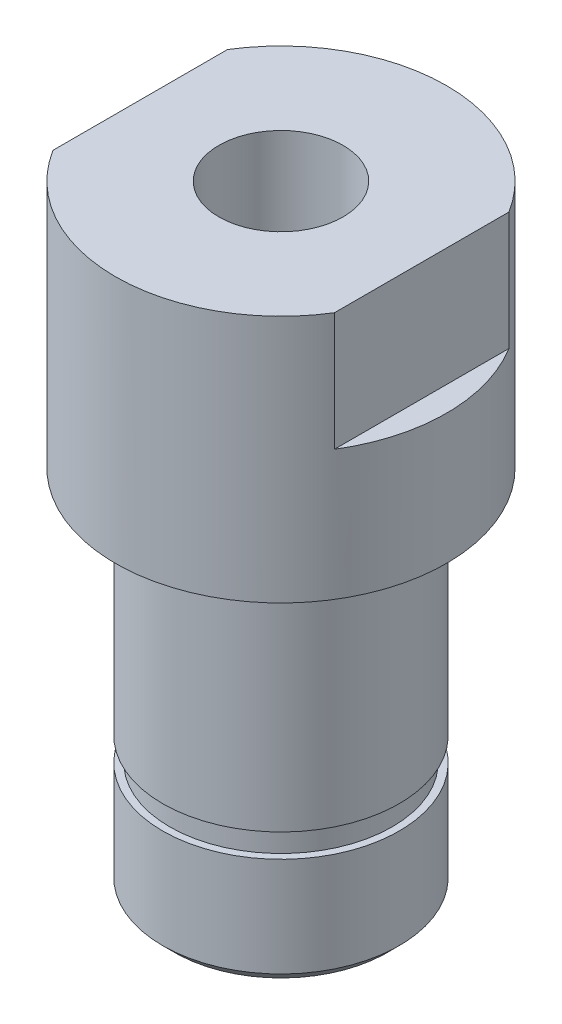
ISO-10303-21;
HEADER;
FILE_DESCRIPTION(('STEP AP214'),'2;1');
FILE_NAME('part.step','',(''),(''),'','','');
FILE_SCHEMA(('AUTOMOTIVE_DESIGN { 1 0 10303 214 1 1 1 1 }'));
ENDSEC;
DATA;
#1=APPLICATION_CONTEXT('core data for automotive mechanical design processes');
#2=APPLICATION_PROTOCOL_DEFINITION('international standard','automotive_design',2000,#1);
#3=PRODUCT_CONTEXT('',#1,'mechanical');
#4=PRODUCT('Part','Part','',(#3));
#5=PRODUCT_RELATED_PRODUCT_CATEGORY('part','',(#4));
#6=PRODUCT_DEFINITION_FORMATION('','',#4);
#7=PRODUCT_DEFINITION_CONTEXT('part definition',#1,'design');
#8=PRODUCT_DEFINITION('design','',#6,#7);
#9=PRODUCT_DEFINITION_SHAPE('','',#8);
#10=(LENGTH_UNIT() NAMED_UNIT(*) SI_UNIT(.MILLI.,.METRE.));
#11=(NAMED_UNIT(*) PLANE_ANGLE_UNIT() SI_UNIT($,.RADIAN.));
#12=(NAMED_UNIT(*) SI_UNIT($,.STERADIAN.) SOLID_ANGLE_UNIT());
#13=UNCERTAINTY_MEASURE_WITH_UNIT(LENGTH_MEASURE(1.E-05),#10,'distance_accuracy_value','');
#14=(GEOMETRIC_REPRESENTATION_CONTEXT(3) GLOBAL_UNCERTAINTY_ASSIGNED_CONTEXT((#13)) GLOBAL_UNIT_ASSIGNED_CONTEXT((#10,
#11,#12)) REPRESENTATION_CONTEXT('',''));
#15=CARTESIAN_POINT('',(0.,0.,0.));
#16=DIRECTION('',(0.,0.,1.));
#17=DIRECTION('',(1.,0.,0.));
#18=AXIS2_PLACEMENT_3D('',#15,#16,#17);
#19=CARTESIAN_POINT('',(0.,-46.,0.));
#20=DIRECTION('',(0.,1.,0.));
#21=DIRECTION('',(0.,0.,1.));
#22=AXIS2_PLACEMENT_3D('',#19,#20,#21);
#23=CYLINDRICAL_SURFACE('',#22,10.);
#24=CARTESIAN_POINT('',(0.,-15.,0.));
#25=DIRECTION('',(0.,-1.,0.));
#26=DIRECTION('',(0.,0.,-1.));
#27=AXIS2_PLACEMENT_3D('',#24,#25,#26);
#28=CIRCLE('',#27,10.);
#29=CARTESIAN_POINT('',(0.,-15.,-10.));
#30=VERTEX_POINT('',#29);
#31=EDGE_CURVE('E131',#30,#30,#28,.T.);
#32=ORIENTED_EDGE('',*,*,#31,.T.);
#33=EDGE_LOOP('',(#32));
#34=FACE_BOUND('',#33,.T.);
#35=CARTESIAN_POINT('',(0.,-34.6,0.));
#36=DIRECTION('',(0.,-1.,0.));
#37=DIRECTION('',(0.,0.,-1.));
#38=AXIS2_PLACEMENT_3D('',#35,#36,#37);
#39=CIRCLE('',#38,10.);
#40=CARTESIAN_POINT('',(0.,-34.6,-10.));
#41=VERTEX_POINT('',#40);
#42=EDGE_CURVE('E60',#41,#41,#39,.T.);
#43=ORIENTED_EDGE('',*,*,#42,.F.);
#44=EDGE_LOOP('',(#43));
#45=FACE_BOUND('',#44,.T.);
#46=ADVANCED_FACE('F55',(#34,#45),#23,.T.);
#47=CARTESIAN_POINT('',(0.,6.,0.));
#48=DIRECTION('',(0.,-1.,0.));
#49=DIRECTION('',(0.,0.,-1.));
#50=AXIS2_PLACEMENT_3D('',#47,#48,#49);
#51=CYLINDRICAL_SURFACE('',#50,14.);
#52=CARTESIAN_POINT('',(0.,6.,0.));
#53=DIRECTION('',(0.,1.,0.));
#54=DIRECTION('',(0.,0.,1.));
#55=AXIS2_PLACEMENT_3D('',#52,#53,#54);
#56=CIRCLE('',#55,14.);
#57=CARTESIAN_POINT('',(-11.9,6.,7.37495762699692));
#58=VERTEX_POINT('',#57);
#59=CARTESIAN_POINT('',(11.9,6.,7.37495762699692));
#60=VERTEX_POINT('',#59);
#61=EDGE_CURVE('E119',#58,#60,#56,.T.);
#62=ORIENTED_EDGE('',*,*,#61,.F.);
#63=DIRECTION('',(0.,-1.,0.));
#64=VECTOR('',#63,1.);
#65=CARTESIAN_POINT('',(-11.9,6.,7.37495762699692));
#66=LINE('',#65,#64);
#67=CARTESIAN_POINT('',(-11.9,-4.,7.37495762699692));
#68=VERTEX_POINT('',#67);
#69=EDGE_CURVE('E74',#58,#68,#66,.T.);
#70=ORIENTED_EDGE('',*,*,#69,.T.);
#71=CARTESIAN_POINT('',(0.,-4.,0.));
#72=DIRECTION('',(0.,1.,0.));
#73=DIRECTION('',(0.,0.,1.));
#74=AXIS2_PLACEMENT_3D('',#71,#72,#73);
#75=CIRCLE('',#74,14.);
#76=CARTESIAN_POINT('',(-11.9,-4.,-7.37495762699692));
#77=VERTEX_POINT('',#76);
#78=EDGE_CURVE('E13',#77,#68,#75,.T.);
#79=ORIENTED_EDGE('',*,*,#78,.F.);
#80=DIRECTION('',(0.,-1.,0.));
#81=VECTOR('',#80,1.);
#82=CARTESIAN_POINT('',(-11.9,6.,-7.37495762699692));
#83=LINE('',#82,#81);
#84=CARTESIAN_POINT('',(-11.9,6.,-7.37495762699692));
#85=VERTEX_POINT('',#84);
#86=EDGE_CURVE('E173',#77,#85,#83,.F.);
#87=ORIENTED_EDGE('',*,*,#86,.T.);
#88=CARTESIAN_POINT('',(11.9,6.,-7.37495762699692));
#89=VERTEX_POINT('',#88);
#90=EDGE_CURVE('E126',#89,#85,#56,.T.);
#91=ORIENTED_EDGE('',*,*,#90,.F.);
#92=DIRECTION('',(0.,-1.,0.));
#93=VECTOR('',#92,1.);
#94=CARTESIAN_POINT('',(11.9,6.,-7.37495762699692));
#95=LINE('',#94,#93);
#96=CARTESIAN_POINT('',(11.9,-4.,-7.37495762699692));
#97=VERTEX_POINT('',#96);
#98=EDGE_CURVE('E82',#89,#97,#95,.T.);
#99=ORIENTED_EDGE('',*,*,#98,.T.);
#100=CARTESIAN_POINT('',(0.,-4.,0.));
#101=DIRECTION('',(0.,-1.,0.));
#102=DIRECTION('',(0.,0.,-1.));
#103=AXIS2_PLACEMENT_3D('',#100,#101,#102);
#104=CIRCLE('',#103,14.);
#105=CARTESIAN_POINT('',(11.9,-4.,7.37495762699692));
#106=VERTEX_POINT('',#105);
#107=EDGE_CURVE('E66',#97,#106,#104,.T.);
#108=ORIENTED_EDGE('',*,*,#107,.T.);
#109=DIRECTION('',(0.,-1.,0.));
#110=VECTOR('',#109,1.);
#111=CARTESIAN_POINT('',(11.9,6.,7.37495762699692));
#112=LINE('',#111,#110);
#113=EDGE_CURVE('E104',#106,#60,#112,.F.);
#114=ORIENTED_EDGE('',*,*,#113,.T.);
#115=EDGE_LOOP('',(#62,#70,#79,#87,#91,#99,#108,#114));
#116=FACE_BOUND('',#115,.T.);
#117=CARTESIAN_POINT('',(0.,-15.,0.));
#118=DIRECTION('',(0.,-1.,0.));
#119=DIRECTION('',(0.,0.,-1.));
#120=AXIS2_PLACEMENT_3D('',#117,#118,#119);
#121=CIRCLE('',#120,14.);
#122=CARTESIAN_POINT('',(0.,-15.,-14.));
#123=VERTEX_POINT('',#122);
#124=EDGE_CURVE('E127',#123,#123,#121,.T.);
#125=ORIENTED_EDGE('',*,*,#124,.F.);
#126=EDGE_LOOP('',(#125));
#127=FACE_BOUND('',#126,.T.);
#128=ADVANCED_FACE('F117',(#116,#127),#51,.T.);
#129=CARTESIAN_POINT('',(0.,6.,0.));
#130=DIRECTION('',(0.,1.,0.));
#131=DIRECTION('',(0.,0.,1.));
#132=AXIS2_PLACEMENT_3D('',#129,#130,#131);
#133=PLANE('',#132);
#134=DIRECTION('',(0.,0.,-1.));
#135=VECTOR('',#134,1.);
#136=CARTESIAN_POINT('',(-11.9,6.,0.));
#137=LINE('',#136,#135);
#138=EDGE_CURVE('E111',#58,#85,#137,.T.);
#139=ORIENTED_EDGE('',*,*,#138,.F.);
#140=ORIENTED_EDGE('',*,*,#61,.T.);
#141=DIRECTION('',(0.,0.,1.));
#142=VECTOR('',#141,1.);
#143=CARTESIAN_POINT('',(11.9,6.,0.));
#144=LINE('',#143,#142);
#145=EDGE_CURVE('E101',#89,#60,#144,.T.);
#146=ORIENTED_EDGE('',*,*,#145,.F.);
#147=ORIENTED_EDGE('',*,*,#90,.T.);
#148=EDGE_LOOP('',(#139,#140,#146,#147));
#149=FACE_BOUND('',#148,.T.);
#150=CARTESIAN_POINT('',(0.,6.,0.));
#151=DIRECTION('',(0.,1.,0.));
#152=DIRECTION('',(0.,0.,1.));
#153=AXIS2_PLACEMENT_3D('',#150,#151,#152);
#154=CIRCLE('',#153,5.25);
#155=CARTESIAN_POINT('',(0.,6.,5.25));
#156=VERTEX_POINT('',#155);
#157=EDGE_CURVE('E179',#156,#156,#154,.T.);
#158=ORIENTED_EDGE('',*,*,#157,.F.);
#159=EDGE_LOOP('',(#158));
#160=FACE_BOUND('',#159,.T.);
#161=ADVANCED_FACE('F123',(#149,#160),#133,.T.);
#162=CARTESIAN_POINT('',(0.,-15.,0.));
#163=DIRECTION('',(0.,-1.,0.));
#164=DIRECTION('',(0.,0.,-1.));
#165=AXIS2_PLACEMENT_3D('',#162,#163,#164);
#166=PLANE('',#165);
#167=ORIENTED_EDGE('',*,*,#31,.F.);
#168=EDGE_LOOP('',(#167));
#169=FACE_BOUND('',#168,.T.);
#170=ORIENTED_EDGE('',*,*,#124,.T.);
#171=EDGE_LOOP('',(#170));
#172=FACE_BOUND('',#171,.T.);
#173=ADVANCED_FACE('F191',(#169,#172),#166,.T.);
#174=CARTESIAN_POINT('',(0.,-16.,0.));
#175=DIRECTION('',(0.,1.,0.));
#176=DIRECTION('',(0.,0.,1.));
#177=AXIS2_PLACEMENT_3D('',#174,#175,#176);
#178=CONICAL_SURFACE('',#177,5.25,1.02974425867665);
#179=CARTESIAN_POINT('',(0.,-19.1545182498947,0.));
#180=VERTEX_POINT('',#179);
#181=VERTEX_LOOP('',#180);
#182=FACE_BOUND('',#181,.T.);
#183=CARTESIAN_POINT('',(0.,-16.,0.));
#184=DIRECTION('',(0.,1.,0.));
#185=DIRECTION('',(0.,0.,1.));
#186=AXIS2_PLACEMENT_3D('',#183,#184,#185);
#187=CIRCLE('',#186,5.25);
#188=CARTESIAN_POINT('',(0.,-16.,5.25));
#189=VERTEX_POINT('',#188);
#190=EDGE_CURVE('E133',#189,#189,#187,.T.);
#191=ORIENTED_EDGE('',*,*,#190,.T.);
#192=EDGE_LOOP('',(#191));
#193=FACE_BOUND('',#192,.T.);
#194=ADVANCED_FACE('F194',(#182,#193),#178,.F.);
#195=CARTESIAN_POINT('',(0.,6.,0.));
#196=DIRECTION('',(0.,1.,0.));
#197=DIRECTION('',(0.,0.,1.));
#198=AXIS2_PLACEMENT_3D('',#195,#196,#197);
#199=CYLINDRICAL_SURFACE('',#198,5.25);
#200=ORIENTED_EDGE('',*,*,#190,.F.);
#201=EDGE_LOOP('',(#200));
#202=FACE_BOUND('',#201,.T.);
#203=ORIENTED_EDGE('',*,*,#157,.T.);
#204=EDGE_LOOP('',(#203));
#205=FACE_BOUND('',#204,.T.);
#206=ADVANCED_FACE('F213',(#202,#205),#199,.F.);
#207=CARTESIAN_POINT('',(0.,-4.,0.));
#208=DIRECTION('',(0.,-1.,0.));
#209=DIRECTION('',(0.,0.,-1.));
#210=AXIS2_PLACEMENT_3D('',#207,#208,#209);
#211=PLANE('',#210);
#212=DIRECTION('',(0.,0.,1.));
#213=VECTOR('',#212,1.);
#214=CARTESIAN_POINT('',(11.9,-4.,16.7854175646507));
#215=LINE('',#214,#213);
#216=EDGE_CURVE('E156',#97,#106,#215,.T.);
#217=ORIENTED_EDGE('',*,*,#216,.T.);
#218=ORIENTED_EDGE('',*,*,#107,.F.);
#219=EDGE_LOOP('',(#217,#218));
#220=FACE_BOUND('',#219,.T.);
#221=ADVANCED_FACE('F217',(#220),#211,.F.);
#222=CARTESIAN_POINT('',(11.9,-4.,16.7854175646507));
#223=DIRECTION('',(-1.,0.,0.));
#224=DIRECTION('',(0.,0.,1.));
#225=AXIS2_PLACEMENT_3D('',#222,#223,#224);
#226=PLANE('',#225);
#227=ORIENTED_EDGE('',*,*,#145,.T.);
#228=ORIENTED_EDGE('',*,*,#113,.F.);
#229=ORIENTED_EDGE('',*,*,#216,.F.);
#230=ORIENTED_EDGE('',*,*,#98,.F.);
#231=EDGE_LOOP('',(#227,#228,#229,#230));
#232=FACE_BOUND('',#231,.T.);
#233=ADVANCED_FACE('F103',(#232),#226,.F.);
#234=CARTESIAN_POINT('',(0.,-4.,0.));
#235=DIRECTION('',(0.,1.,0.));
#236=DIRECTION('',(0.,0.,1.));
#237=AXIS2_PLACEMENT_3D('',#234,#235,#236);
#238=PLANE('',#237);
#239=ORIENTED_EDGE('',*,*,#78,.T.);
#240=DIRECTION('',(0.,0.,-1.));
#241=VECTOR('',#240,1.);
#242=CARTESIAN_POINT('',(-11.9,-4.,16.7854175646507));
#243=LINE('',#242,#241);
#244=EDGE_CURVE('E121',#68,#77,#243,.T.);
#245=ORIENTED_EDGE('',*,*,#244,.T.);
#246=EDGE_LOOP('',(#239,#245));
#247=FACE_BOUND('',#246,.T.);
#248=ADVANCED_FACE('F221',(#247),#238,.T.);
#249=CARTESIAN_POINT('',(-11.9,-4.,16.7854175646507));
#250=DIRECTION('',(1.,0.,0.));
#251=DIRECTION('',(0.,0.,-1.));
#252=AXIS2_PLACEMENT_3D('',#249,#250,#251);
#253=PLANE('',#252);
#254=ORIENTED_EDGE('',*,*,#138,.T.);
#255=ORIENTED_EDGE('',*,*,#86,.F.);
#256=ORIENTED_EDGE('',*,*,#244,.F.);
#257=ORIENTED_EDGE('',*,*,#69,.F.);
#258=EDGE_LOOP('',(#254,#255,#256,#257));
#259=FACE_BOUND('',#258,.T.);
#260=ADVANCED_FACE('F225',(#259),#253,.F.);
#261=CARTESIAN_POINT('',(0.,-34.6,10.6));
#262=DIRECTION('',(0.,-1.,0.));
#263=DIRECTION('',(0.,0.,-1.));
#264=AXIS2_PLACEMENT_3D('',#261,#262,#263);
#265=PLANE('',#264);
#266=CARTESIAN_POINT('',(0.,-34.6,0.));
#267=DIRECTION('',(0.,-1.,0.));
#268=DIRECTION('',(0.,0.,-1.));
#269=AXIS2_PLACEMENT_3D('',#266,#267,#268);
#270=CIRCLE('',#269,9.4);
#271=CARTESIAN_POINT('',(0.,-34.6,-9.4));
#272=VERTEX_POINT('',#271);
#273=EDGE_CURVE('E150',#272,#272,#270,.T.);
#274=ORIENTED_EDGE('',*,*,#273,.F.);
#275=EDGE_LOOP('',(#274));
#276=FACE_BOUND('',#275,.T.);
#277=ORIENTED_EDGE('',*,*,#42,.T.);
#278=EDGE_LOOP('',(#277));
#279=FACE_BOUND('',#278,.T.);
#280=ADVANCED_FACE('F228',(#276,#279),#265,.T.);
#281=CARTESIAN_POINT('',(0.,-36.6,10.6));
#282=DIRECTION('',(0.,1.,0.));
#283=DIRECTION('',(0.,0.,1.));
#284=AXIS2_PLACEMENT_3D('',#281,#282,#283);
#285=PLANE('',#284);
#286=CARTESIAN_POINT('',(0.,-36.6,0.));
#287=DIRECTION('',(0.,-1.,0.));
#288=DIRECTION('',(0.,0.,-1.));
#289=AXIS2_PLACEMENT_3D('',#286,#287,#288);
#290=CIRCLE('',#289,9.4);
#291=CARTESIAN_POINT('',(0.,-36.6,-9.4));
#292=VERTEX_POINT('',#291);
#293=EDGE_CURVE('E158',#292,#292,#290,.T.);
#294=ORIENTED_EDGE('',*,*,#293,.T.);
#295=EDGE_LOOP('',(#294));
#296=FACE_BOUND('',#295,.T.);
#297=CARTESIAN_POINT('',(0.,-36.6,0.));
#298=DIRECTION('',(0.,1.,0.));
#299=DIRECTION('',(0.,0.,1.));
#300=AXIS2_PLACEMENT_3D('',#297,#298,#299);
#301=CIRCLE('',#300,10.);
#302=CARTESIAN_POINT('',(0.,-36.6,10.));
#303=VERTEX_POINT('',#302);
#304=EDGE_CURVE('E147',#303,#303,#301,.T.);
#305=ORIENTED_EDGE('',*,*,#304,.T.);
#306=EDGE_LOOP('',(#305));
#307=FACE_BOUND('',#306,.T.);
#308=ADVANCED_FACE('F234',(#296,#307),#285,.T.);
#309=CARTESIAN_POINT('',(0.,-45.,0.));
#310=DIRECTION('',(0.,-1.,0.));
#311=DIRECTION('',(0.,0.,-1.));
#312=AXIS2_PLACEMENT_3D('',#309,#310,#311);
#313=CYLINDRICAL_SURFACE('',#312,9.4);
#314=ORIENTED_EDGE('',*,*,#273,.T.);
#315=EDGE_LOOP('',(#314));
#316=FACE_BOUND('',#315,.T.);
#317=ORIENTED_EDGE('',*,*,#293,.F.);
#318=EDGE_LOOP('',(#317));
#319=FACE_BOUND('',#318,.T.);
#320=ADVANCED_FACE('F209',(#316,#319),#313,.T.);
#321=CARTESIAN_POINT('',(0.,-46.,0.));
#322=DIRECTION('',(0.,-1.,0.));
#323=DIRECTION('',(0.,0.,-1.));
#324=AXIS2_PLACEMENT_3D('',#321,#322,#323);
#325=PLANE('',#324);
#326=CARTESIAN_POINT('',(0.,-46.,0.));
#327=DIRECTION('',(0.,-1.,0.));
#328=DIRECTION('',(0.,0.,-1.));
#329=AXIS2_PLACEMENT_3D('',#326,#327,#328);
#330=CIRCLE('',#329,9.);
#331=CARTESIAN_POINT('',(0.,-46.,-9.));
#332=VERTEX_POINT('',#331);
#333=EDGE_CURVE('E137',#332,#332,#330,.T.);
#334=ORIENTED_EDGE('',*,*,#333,.T.);
#335=EDGE_LOOP('',(#334));
#336=FACE_BOUND('',#335,.T.);
#337=ADVANCED_FACE('F206',(#336),#325,.T.);
#338=CARTESIAN_POINT('',(0.,-46.,0.));
#339=DIRECTION('',(0.,1.,0.));
#340=DIRECTION('',(0.,0.,1.));
#341=AXIS2_PLACEMENT_3D('',#338,#339,#340);
#342=CONICAL_SURFACE('',#341,9.,0.785398163397444);
#343=CARTESIAN_POINT('',(0.,-45.,0.));
#344=DIRECTION('',(0.,-1.,0.));
#345=DIRECTION('',(0.,0.,-1.));
#346=AXIS2_PLACEMENT_3D('',#343,#344,#345);
#347=CIRCLE('',#346,10.);
#348=CARTESIAN_POINT('',(0.,-45.,-10.));
#349=VERTEX_POINT('',#348);
#350=EDGE_CURVE('E112',#349,#349,#347,.F.);
#351=ORIENTED_EDGE('',*,*,#350,.F.);
#352=EDGE_LOOP('',(#351));
#353=FACE_BOUND('',#352,.T.);
#354=ORIENTED_EDGE('',*,*,#333,.F.);
#355=EDGE_LOOP('',(#354));
#356=FACE_BOUND('',#355,.T.);
#357=ADVANCED_FACE('F58',(#353,#356),#342,.T.);
#358=ORIENTED_EDGE('',*,*,#350,.T.);
#359=EDGE_LOOP('',(#358));
#360=FACE_BOUND('',#359,.T.);
#361=ORIENTED_EDGE('',*,*,#304,.F.);
#362=EDGE_LOOP('',(#361));
#363=FACE_BOUND('',#362,.T.);
#364=ADVANCED_FACE('F204',(#360,#363),#23,.T.);
#365=CLOSED_SHELL('',(#46,#128,#161,#173,#194,#206,#221,#233,#248,#260,#280,#308,#320,#337,#357,#364));
#366=MANIFOLD_SOLID_BREP('B2',#365);
#367=ADVANCED_BREP_SHAPE_REPRESENTATION('',(#18,#366),#14);
#368=SHAPE_DEFINITION_REPRESENTATION(#9,#367);
ENDSEC;
END-ISO-10303-21;
